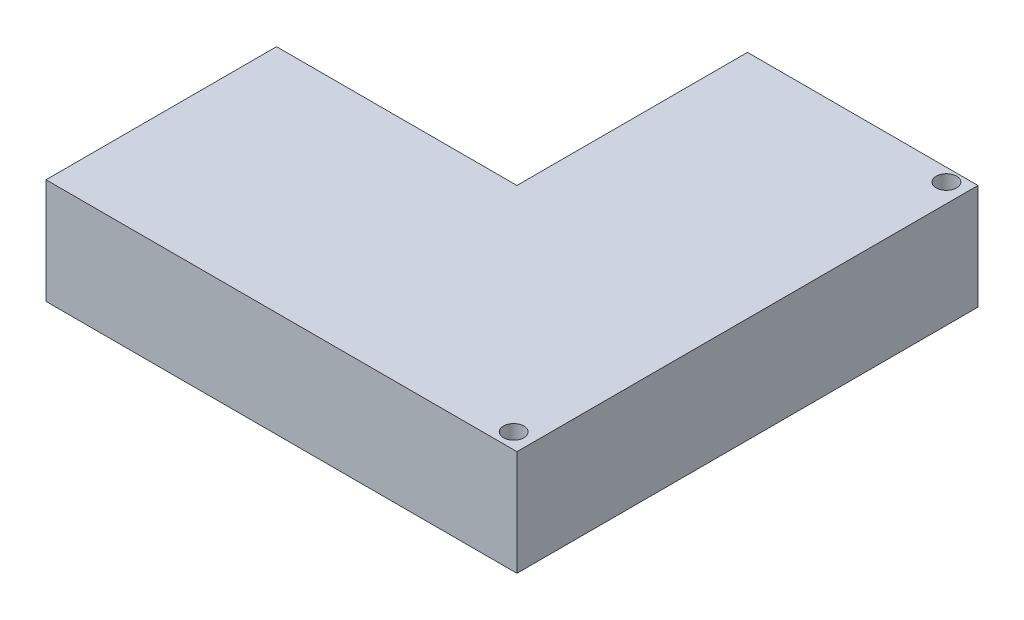
ISO-10303-21;
HEADER;
FILE_DESCRIPTION(('STEP AP214'),'2;1');
FILE_NAME('part.step','',(''),(''),'','','');
FILE_SCHEMA(('AUTOMOTIVE_DESIGN { 1 0 10303 214 1 1 1 1 }'));
ENDSEC;
DATA;
#1=APPLICATION_CONTEXT('core data for automotive mechanical design processes');
#2=APPLICATION_PROTOCOL_DEFINITION('international standard','automotive_design',2000,#1);
#3=PRODUCT_CONTEXT('',#1,'mechanical');
#4=PRODUCT('Part','Part','',(#3));
#5=PRODUCT_RELATED_PRODUCT_CATEGORY('part','',(#4));
#6=PRODUCT_DEFINITION_FORMATION('','',#4);
#7=PRODUCT_DEFINITION_CONTEXT('part definition',#1,'design');
#8=PRODUCT_DEFINITION('design','',#6,#7);
#9=PRODUCT_DEFINITION_SHAPE('','',#8);
#10=(LENGTH_UNIT() NAMED_UNIT(*) SI_UNIT(.MILLI.,.METRE.));
#11=(NAMED_UNIT(*) PLANE_ANGLE_UNIT() SI_UNIT($,.RADIAN.));
#12=(NAMED_UNIT(*) SI_UNIT($,.STERADIAN.) SOLID_ANGLE_UNIT());
#13=UNCERTAINTY_MEASURE_WITH_UNIT(LENGTH_MEASURE(1.E-05),#10,'distance_accuracy_value','');
#14=(GEOMETRIC_REPRESENTATION_CONTEXT(3) GLOBAL_UNCERTAINTY_ASSIGNED_CONTEXT((#13)) GLOBAL_UNIT_ASSIGNED_CONTEXT((#10,
#11,#12)) REPRESENTATION_CONTEXT('',''));
#15=CARTESIAN_POINT('',(0.,0.,0.));
#16=DIRECTION('',(0.,0.,1.));
#17=DIRECTION('',(1.,0.,0.));
#18=AXIS2_PLACEMENT_3D('',#15,#16,#17);
#19=CARTESIAN_POINT('',(-13.7961871538366,-8.,46.5082136991387));
#20=DIRECTION('',(0.,0.,-1.));
#21=DIRECTION('',(-1.,0.,0.));
#22=AXIS2_PLACEMENT_3D('',#19,#20,#21);
#23=PLANE('',#22);
#24=DIRECTION('',(-1.,0.,0.));
#25=VECTOR('',#24,1.);
#26=CARTESIAN_POINT('',(-13.7961871538366,8.,46.5082136991387));
#27=LINE('',#26,#25);
#28=CARTESIAN_POINT('',(-13.7961871538366,8.,46.5082136991387));
#29=VERTEX_POINT('',#28);
#30=CARTESIAN_POINT('',(-85.2961871538366,8.,46.5082136991387));
#31=VERTEX_POINT('',#30);
#32=EDGE_CURVE('E121',#29,#31,#27,.T.);
#33=ORIENTED_EDGE('',*,*,#32,.T.);
#34=DIRECTION('',(0.,1.,0.));
#35=VECTOR('',#34,1.);
#36=CARTESIAN_POINT('',(-85.2961871538366,-8.,46.5082136991387));
#37=LINE('',#36,#35);
#38=CARTESIAN_POINT('',(-85.2961871538366,-8.,46.5082136991387));
#39=VERTEX_POINT('',#38);
#40=EDGE_CURVE('E12',#39,#31,#37,.T.);
#41=ORIENTED_EDGE('',*,*,#40,.F.);
#42=DIRECTION('',(-1.,0.,0.));
#43=VECTOR('',#42,1.);
#44=CARTESIAN_POINT('',(-13.7961871538366,-8.,46.5082136991387));
#45=LINE('',#44,#43);
#46=CARTESIAN_POINT('',(-13.7961871538366,-8.,46.5082136991387));
#47=VERTEX_POINT('',#46);
#48=EDGE_CURVE('E133',#47,#39,#45,.T.);
#49=ORIENTED_EDGE('',*,*,#48,.F.);
#50=DIRECTION('',(0.,1.,0.));
#51=VECTOR('',#50,1.);
#52=CARTESIAN_POINT('',(-13.7961871538366,-8.,46.5082136991387));
#53=LINE('',#52,#51);
#54=EDGE_CURVE('E117',#47,#29,#53,.T.);
#55=ORIENTED_EDGE('',*,*,#54,.T.);
#56=EDGE_LOOP('',(#33,#41,#49,#55));
#57=FACE_BOUND('',#56,.T.);
#58=ADVANCED_FACE('F42',(#57),#23,.F.);
#59=CARTESIAN_POINT('',(-85.2961871538366,-8.,46.5082136991387));
#60=DIRECTION('',(1.,0.,0.));
#61=DIRECTION('',(0.,0.,-1.));
#62=AXIS2_PLACEMENT_3D('',#59,#60,#61);
#63=PLANE('',#62);
#64=DIRECTION('',(0.,0.,-1.));
#65=VECTOR('',#64,1.);
#66=CARTESIAN_POINT('',(-85.2961871538366,8.,46.5082136991387));
#67=LINE('',#66,#65);
#68=CARTESIAN_POINT('',(-85.2961871538366,8.,11.5082136991387));
#69=VERTEX_POINT('',#68);
#70=EDGE_CURVE('E124',#31,#69,#67,.T.);
#71=ORIENTED_EDGE('',*,*,#70,.T.);
#72=DIRECTION('',(0.,1.,0.));
#73=VECTOR('',#72,1.);
#74=CARTESIAN_POINT('',(-85.2961871538366,-8.,11.5082136991387));
#75=LINE('',#74,#73);
#76=CARTESIAN_POINT('',(-85.2961871538366,-8.,11.5082136991387));
#77=VERTEX_POINT('',#76);
#78=EDGE_CURVE('E46',#77,#69,#75,.T.);
#79=ORIENTED_EDGE('',*,*,#78,.F.);
#80=DIRECTION('',(0.,0.,-1.));
#81=VECTOR('',#80,1.);
#82=CARTESIAN_POINT('',(-85.2961871538366,-8.,46.5082136991387));
#83=LINE('',#82,#81);
#84=EDGE_CURVE('E87',#39,#77,#83,.T.);
#85=ORIENTED_EDGE('',*,*,#84,.F.);
#86=ORIENTED_EDGE('',*,*,#40,.T.);
#87=EDGE_LOOP('',(#71,#79,#85,#86));
#88=FACE_BOUND('',#87,.T.);
#89=ADVANCED_FACE('F44',(#88),#63,.F.);
#90=CARTESIAN_POINT('',(-104.296187153837,-8.,11.5082136991387));
#91=DIRECTION('',(0.,0.,1.));
#92=DIRECTION('',(1.,0.,0.));
#93=AXIS2_PLACEMENT_3D('',#90,#91,#92);
#94=PLANE('',#93);
#95=DIRECTION('',(1.,0.,0.));
#96=VECTOR('',#95,1.);
#97=CARTESIAN_POINT('',(-104.296187153837,8.,11.5082136991387));
#98=LINE('',#97,#96);
#99=CARTESIAN_POINT('',(-48.7961871538366,8.,11.5082136991386));
#100=VERTEX_POINT('',#99);
#101=EDGE_CURVE('E126',#69,#100,#98,.T.);
#102=ORIENTED_EDGE('',*,*,#101,.T.);
#103=DIRECTION('',(0.,1.,0.));
#104=VECTOR('',#103,1.);
#105=CARTESIAN_POINT('',(-48.7961871538366,-8.,11.5082136991386));
#106=LINE('',#105,#104);
#107=CARTESIAN_POINT('',(-48.7961871538366,-8.,11.5082136991386));
#108=VERTEX_POINT('',#107);
#109=EDGE_CURVE('E111',#108,#100,#106,.T.);
#110=ORIENTED_EDGE('',*,*,#109,.F.);
#111=DIRECTION('',(1.,0.,0.));
#112=VECTOR('',#111,1.);
#113=CARTESIAN_POINT('',(-104.296187153837,-8.,11.5082136991387));
#114=LINE('',#113,#112);
#115=EDGE_CURVE('E92',#77,#108,#114,.T.);
#116=ORIENTED_EDGE('',*,*,#115,.F.);
#117=ORIENTED_EDGE('',*,*,#78,.T.);
#118=EDGE_LOOP('',(#102,#110,#116,#117));
#119=FACE_BOUND('',#118,.T.);
#120=ADVANCED_FACE('F186',(#119),#94,.F.);
#121=CARTESIAN_POINT('',(-48.7961871538366,-8.,11.5082136991386));
#122=DIRECTION('',(1.,0.,0.));
#123=DIRECTION('',(0.,0.,-1.));
#124=AXIS2_PLACEMENT_3D('',#121,#122,#123);
#125=PLANE('',#124);
#126=DIRECTION('',(0.,0.,-1.));
#127=VECTOR('',#126,1.);
#128=CARTESIAN_POINT('',(-48.7961871538366,8.,11.5082136991386));
#129=LINE('',#128,#127);
#130=CARTESIAN_POINT('',(-48.7961871538366,8.,-23.4917863008613));
#131=VERTEX_POINT('',#130);
#132=EDGE_CURVE('E108',#100,#131,#129,.T.);
#133=ORIENTED_EDGE('',*,*,#132,.T.);
#134=DIRECTION('',(0.,1.,0.));
#135=VECTOR('',#134,1.);
#136=CARTESIAN_POINT('',(-48.7961871538366,-8.,-23.4917863008613));
#137=LINE('',#136,#135);
#138=CARTESIAN_POINT('',(-48.7961871538366,-8.,-23.4917863008613));
#139=VERTEX_POINT('',#138);
#140=EDGE_CURVE('E105',#139,#131,#137,.T.);
#141=ORIENTED_EDGE('',*,*,#140,.F.);
#142=DIRECTION('',(0.,0.,-1.));
#143=VECTOR('',#142,1.);
#144=CARTESIAN_POINT('',(-48.7961871538366,-8.,11.5082136991386));
#145=LINE('',#144,#143);
#146=EDGE_CURVE('E95',#108,#139,#145,.T.);
#147=ORIENTED_EDGE('',*,*,#146,.F.);
#148=ORIENTED_EDGE('',*,*,#109,.T.);
#149=EDGE_LOOP('',(#133,#141,#147,#148));
#150=FACE_BOUND('',#149,.T.);
#151=ADVANCED_FACE('F106',(#150),#125,.F.);
#152=CARTESIAN_POINT('',(-13.7961871538366,-8.,-23.4917863008613));
#153=DIRECTION('',(0.,0.,1.));
#154=DIRECTION('',(1.,0.,0.));
#155=AXIS2_PLACEMENT_3D('',#152,#153,#154);
#156=PLANE('',#155);
#157=DIRECTION('',(1.,0.,0.));
#158=VECTOR('',#157,1.);
#159=CARTESIAN_POINT('',(-13.7961871538366,8.,-23.4917863008613));
#160=LINE('',#159,#158);
#161=CARTESIAN_POINT('',(-13.7961871538366,8.,-23.4917863008613));
#162=VERTEX_POINT('',#161);
#163=EDGE_CURVE('E129',#131,#162,#160,.T.);
#164=ORIENTED_EDGE('',*,*,#163,.T.);
#165=DIRECTION('',(0.,1.,0.));
#166=VECTOR('',#165,1.);
#167=CARTESIAN_POINT('',(-13.7961871538366,-8.,-23.4917863008613));
#168=LINE('',#167,#166);
#169=CARTESIAN_POINT('',(-13.7961871538366,-8.,-23.4917863008613));
#170=VERTEX_POINT('',#169);
#171=EDGE_CURVE('E112',#170,#162,#168,.T.);
#172=ORIENTED_EDGE('',*,*,#171,.F.);
#173=DIRECTION('',(1.,0.,0.));
#174=VECTOR('',#173,1.);
#175=CARTESIAN_POINT('',(-13.7961871538366,-8.,-23.4917863008613));
#176=LINE('',#175,#174);
#177=EDGE_CURVE('E99',#139,#170,#176,.T.);
#178=ORIENTED_EDGE('',*,*,#177,.F.);
#179=ORIENTED_EDGE('',*,*,#140,.T.);
#180=EDGE_LOOP('',(#164,#172,#178,#179));
#181=FACE_BOUND('',#180,.T.);
#182=ADVANCED_FACE('F114',(#181),#156,.F.);
#183=CARTESIAN_POINT('',(-13.7961871538366,-8.,46.5082136991387));
#184=DIRECTION('',(-1.,0.,0.));
#185=DIRECTION('',(0.,0.,1.));
#186=AXIS2_PLACEMENT_3D('',#183,#184,#185);
#187=PLANE('',#186);
#188=DIRECTION('',(0.,0.,1.));
#189=VECTOR('',#188,1.);
#190=CARTESIAN_POINT('',(-13.7961871538366,8.,46.5082136991387));
#191=LINE('',#190,#189);
#192=EDGE_CURVE('E131',#162,#29,#191,.T.);
#193=ORIENTED_EDGE('',*,*,#192,.T.);
#194=ORIENTED_EDGE('',*,*,#54,.F.);
#195=DIRECTION('',(0.,0.,1.));
#196=VECTOR('',#195,1.);
#197=CARTESIAN_POINT('',(-13.7961871538366,-8.,46.5082136991387));
#198=LINE('',#197,#196);
#199=EDGE_CURVE('E60',#170,#47,#198,.T.);
#200=ORIENTED_EDGE('',*,*,#199,.F.);
#201=ORIENTED_EDGE('',*,*,#171,.T.);
#202=EDGE_LOOP('',(#193,#194,#200,#201));
#203=FACE_BOUND('',#202,.T.);
#204=ADVANCED_FACE('F167',(#203),#187,.F.);
#205=CARTESIAN_POINT('',(0.,-8.,0.));
#206=DIRECTION('',(0.,-1.,0.));
#207=DIRECTION('',(0.,0.,-1.));
#208=AXIS2_PLACEMENT_3D('',#205,#206,#207);
#209=PLANE('',#208);
#210=CARTESIAN_POINT('',(-16.6461871538366,-8.,44.1582136991387));
#211=DIRECTION('',(0.,-1.,0.));
#212=DIRECTION('',(0.,0.,-1.));
#213=AXIS2_PLACEMENT_3D('',#210,#211,#212);
#214=CIRCLE('',#213,1.55);
#215=CARTESIAN_POINT('',(-16.6461871538366,-8.,42.6082136991387));
#216=VERTEX_POINT('',#215);
#217=EDGE_CURVE('E149',#216,#216,#214,.T.);
#218=ORIENTED_EDGE('',*,*,#217,.F.);
#219=EDGE_LOOP('',(#218));
#220=FACE_BOUND('',#219,.T.);
#221=CARTESIAN_POINT('',(-16.6461871538366,-8.,-21.5417863008613));
#222=DIRECTION('',(0.,-1.,0.));
#223=DIRECTION('',(0.,0.,-1.));
#224=AXIS2_PLACEMENT_3D('',#221,#222,#223);
#225=CIRCLE('',#224,1.55);
#226=CARTESIAN_POINT('',(-16.6461871538366,-8.,-23.0917863008613));
#227=VERTEX_POINT('',#226);
#228=EDGE_CURVE('E146',#227,#227,#225,.T.);
#229=ORIENTED_EDGE('',*,*,#228,.F.);
#230=EDGE_LOOP('',(#229));
#231=FACE_BOUND('',#230,.T.);
#232=ORIENTED_EDGE('',*,*,#48,.T.);
#233=ORIENTED_EDGE('',*,*,#84,.T.);
#234=ORIENTED_EDGE('',*,*,#115,.T.);
#235=ORIENTED_EDGE('',*,*,#146,.T.);
#236=ORIENTED_EDGE('',*,*,#177,.T.);
#237=ORIENTED_EDGE('',*,*,#199,.T.);
#238=EDGE_LOOP('',(#232,#233,#234,#235,#236,#237));
#239=FACE_BOUND('',#238,.T.);
#240=ADVANCED_FACE('F97',(#220,#231,#239),#209,.T.);
#241=CARTESIAN_POINT('',(0.,8.,0.));
#242=DIRECTION('',(0.,-1.,0.));
#243=DIRECTION('',(0.,0.,-1.));
#244=AXIS2_PLACEMENT_3D('',#241,#242,#243);
#245=PLANE('',#244);
#246=CARTESIAN_POINT('',(-16.6461871538366,8.,44.1582136991387));
#247=DIRECTION('',(0.,-1.,0.));
#248=DIRECTION('',(0.,0.,-1.));
#249=AXIS2_PLACEMENT_3D('',#246,#247,#248);
#250=CIRCLE('',#249,1.55);
#251=CARTESIAN_POINT('',(-16.6461871538366,8.,42.6082136991387));
#252=VERTEX_POINT('',#251);
#253=EDGE_CURVE('E125',#252,#252,#250,.T.);
#254=ORIENTED_EDGE('',*,*,#253,.T.);
#255=EDGE_LOOP('',(#254));
#256=FACE_BOUND('',#255,.T.);
#257=CARTESIAN_POINT('',(-16.6461871538366,8.,-21.5417863008613));
#258=DIRECTION('',(0.,-1.,0.));
#259=DIRECTION('',(0.,0.,-1.));
#260=AXIS2_PLACEMENT_3D('',#257,#258,#259);
#261=CIRCLE('',#260,1.55);
#262=CARTESIAN_POINT('',(-16.6461871538366,8.,-23.0917863008613));
#263=VERTEX_POINT('',#262);
#264=EDGE_CURVE('E143',#263,#263,#261,.T.);
#265=ORIENTED_EDGE('',*,*,#264,.T.);
#266=EDGE_LOOP('',(#265));
#267=FACE_BOUND('',#266,.T.);
#268=ORIENTED_EDGE('',*,*,#32,.F.);
#269=ORIENTED_EDGE('',*,*,#192,.F.);
#270=ORIENTED_EDGE('',*,*,#163,.F.);
#271=ORIENTED_EDGE('',*,*,#132,.F.);
#272=ORIENTED_EDGE('',*,*,#101,.F.);
#273=ORIENTED_EDGE('',*,*,#70,.F.);
#274=EDGE_LOOP('',(#268,#269,#270,#271,#272,#273));
#275=FACE_BOUND('',#274,.T.);
#276=ADVANCED_FACE('F155',(#256,#267,#275),#245,.F.);
#277=CARTESIAN_POINT('',(-16.6461871538366,8.,-21.5417863008613));
#278=DIRECTION('',(0.,-1.,0.));
#279=DIRECTION('',(0.,0.,-1.));
#280=AXIS2_PLACEMENT_3D('',#277,#278,#279);
#281=CYLINDRICAL_SURFACE('',#280,1.55);
#282=ORIENTED_EDGE('',*,*,#264,.F.);
#283=EDGE_LOOP('',(#282));
#284=FACE_BOUND('',#283,.T.);
#285=ORIENTED_EDGE('',*,*,#228,.T.);
#286=EDGE_LOOP('',(#285));
#287=FACE_BOUND('',#286,.T.);
#288=ADVANCED_FACE('F161',(#284,#287),#281,.F.);
#289=CARTESIAN_POINT('',(-16.6461871538366,8.,44.1582136991387));
#290=DIRECTION('',(0.,-1.,0.));
#291=DIRECTION('',(0.,0.,-1.));
#292=AXIS2_PLACEMENT_3D('',#289,#290,#291);
#293=CYLINDRICAL_SURFACE('',#292,1.55);
#294=ORIENTED_EDGE('',*,*,#253,.F.);
#295=EDGE_LOOP('',(#294));
#296=FACE_BOUND('',#295,.T.);
#297=ORIENTED_EDGE('',*,*,#217,.T.);
#298=EDGE_LOOP('',(#297));
#299=FACE_BOUND('',#298,.T.);
#300=ADVANCED_FACE('F158',(#296,#299),#293,.F.);
#301=CLOSED_SHELL('',(#58,#89,#120,#151,#182,#204,#240,#276,#288,#300));
#302=MANIFOLD_SOLID_BREP('B2',#301);
#303=ADVANCED_BREP_SHAPE_REPRESENTATION('',(#18,#302),#14);
#304=SHAPE_DEFINITION_REPRESENTATION(#9,#303);
ENDSEC;
END-ISO-10303-21;
